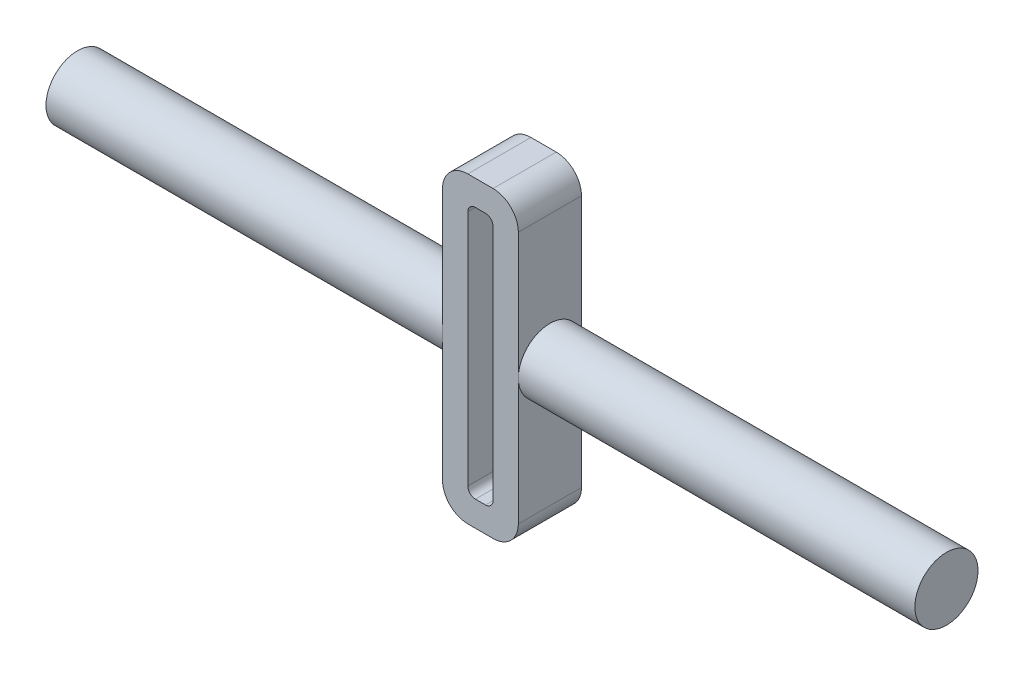
ISO-10303-21;
HEADER;
FILE_DESCRIPTION(('STEP AP214'),'2;1');
FILE_NAME('part.step','',(''),(''),'','','');
FILE_SCHEMA(('AUTOMOTIVE_DESIGN { 1 0 10303 214 1 1 1 1 }'));
ENDSEC;
DATA;
#1=APPLICATION_CONTEXT('core data for automotive mechanical design processes');
#2=APPLICATION_PROTOCOL_DEFINITION('international standard','automotive_design',2000,#1);
#3=PRODUCT_CONTEXT('',#1,'mechanical');
#4=PRODUCT('Part','Part','',(#3));
#5=PRODUCT_RELATED_PRODUCT_CATEGORY('part','',(#4));
#6=PRODUCT_DEFINITION_FORMATION('','',#4);
#7=PRODUCT_DEFINITION_CONTEXT('part definition',#1,'design');
#8=PRODUCT_DEFINITION('design','',#6,#7);
#9=PRODUCT_DEFINITION_SHAPE('','',#8);
#10=(LENGTH_UNIT() NAMED_UNIT(*) SI_UNIT(.MILLI.,.METRE.));
#11=(NAMED_UNIT(*) PLANE_ANGLE_UNIT() SI_UNIT($,.RADIAN.));
#12=(NAMED_UNIT(*) SI_UNIT($,.STERADIAN.) SOLID_ANGLE_UNIT());
#13=UNCERTAINTY_MEASURE_WITH_UNIT(LENGTH_MEASURE(1.E-05),#10,'distance_accuracy_value','');
#14=(GEOMETRIC_REPRESENTATION_CONTEXT(3) GLOBAL_UNCERTAINTY_ASSIGNED_CONTEXT((#13)) GLOBAL_UNIT_ASSIGNED_CONTEXT((#10,
#11,#12)) REPRESENTATION_CONTEXT('',''));
#15=CARTESIAN_POINT('',(0.,0.,0.));
#16=DIRECTION('',(0.,0.,1.));
#17=DIRECTION('',(1.,0.,0.));
#18=AXIS2_PLACEMENT_3D('',#15,#16,#17);
#19=CARTESIAN_POINT('',(-175.,0.,12.5));
#20=DIRECTION('',(1.,0.,0.));
#21=DIRECTION('',(0.,1.,0.));
#22=AXIS2_PLACEMENT_3D('',#19,#20,#21);
#23=CYLINDRICAL_SURFACE('',#22,12.5);
#24=CARTESIAN_POINT('',(-15.,0.,12.5));
#25=DIRECTION('',(1.,0.,0.));
#26=DIRECTION('',(0.,1.,0.));
#27=AXIS2_PLACEMENT_3D('',#24,#25,#26);
#28=CIRCLE('',#27,12.5);
#29=CARTESIAN_POINT('',(-15.,0.,25.));
#30=VERTEX_POINT('',#29);
#31=CARTESIAN_POINT('',(-15.,0.,0.));
#32=VERTEX_POINT('',#31);
#33=EDGE_CURVE('E188',#30,#32,#28,.T.);
#34=ORIENTED_EDGE('',*,*,#33,.F.);
#35=EDGE_CURVE('E180',#32,#30,#28,.T.);
#36=ORIENTED_EDGE('',*,*,#35,.F.);
#37=EDGE_LOOP('',(#34,#36));
#38=FACE_BOUND('',#37,.T.);
#39=CARTESIAN_POINT('',(-172.,0.,12.5));
#40=DIRECTION('',(-1.,0.,0.));
#41=DIRECTION('',(0.,-1.,0.));
#42=AXIS2_PLACEMENT_3D('',#39,#40,#41);
#43=CIRCLE('',#42,12.5);
#44=CARTESIAN_POINT('',(-172.,-12.5,12.5));
#45=VERTEX_POINT('',#44);
#46=EDGE_CURVE('E434',#45,#45,#43,.T.);
#47=ORIENTED_EDGE('',*,*,#46,.F.);
#48=EDGE_LOOP('',(#47));
#49=FACE_BOUND('',#48,.T.);
#50=ADVANCED_FACE('F33',(#38,#49),#23,.T.);
#51=CARTESIAN_POINT('',(175.,0.,12.5));
#52=DIRECTION('',(-1.,0.,0.));
#53=DIRECTION('',(0.,-1.,0.));
#54=AXIS2_PLACEMENT_3D('',#51,#52,#53);
#55=CYLINDRICAL_SURFACE('',#54,12.5);
#56=CARTESIAN_POINT('',(15.,0.,12.5));
#57=DIRECTION('',(-1.,0.,0.));
#58=DIRECTION('',(0.,-1.,0.));
#59=AXIS2_PLACEMENT_3D('',#56,#57,#58);
#60=CIRCLE('',#59,12.5);
#61=CARTESIAN_POINT('',(15.,0.,25.));
#62=VERTEX_POINT('',#61);
#63=CARTESIAN_POINT('',(15.,0.,0.));
#64=VERTEX_POINT('',#63);
#65=EDGE_CURVE('E178',#62,#64,#60,.T.);
#66=ORIENTED_EDGE('',*,*,#65,.F.);
#67=EDGE_CURVE('E165',#64,#62,#60,.T.);
#68=ORIENTED_EDGE('',*,*,#67,.F.);
#69=EDGE_LOOP('',(#66,#68));
#70=FACE_BOUND('',#69,.T.);
#71=CARTESIAN_POINT('',(172.,0.,12.5));
#72=DIRECTION('',(1.,0.,0.));
#73=DIRECTION('',(0.,1.,0.));
#74=AXIS2_PLACEMENT_3D('',#71,#72,#73);
#75=CIRCLE('',#74,12.5);
#76=CARTESIAN_POINT('',(172.,12.5,12.5));
#77=VERTEX_POINT('',#76);
#78=EDGE_CURVE('E189',#77,#77,#75,.T.);
#79=ORIENTED_EDGE('',*,*,#78,.F.);
#80=EDGE_LOOP('',(#79));
#81=FACE_BOUND('',#80,.T.);
#82=ADVANCED_FACE('F176',(#70,#81),#55,.T.);
#83=CARTESIAN_POINT('',(15.,-60.,0.));
#84=DIRECTION('',(1.,0.,0.));
#85=DIRECTION('',(0.,1.,0.));
#86=AXIS2_PLACEMENT_3D('',#83,#84,#85);
#87=PLANE('',#86);
#88=DIRECTION('',(0.,1.,0.));
#89=VECTOR('',#88,1.);
#90=CARTESIAN_POINT('',(15.,-60.,0.));
#91=LINE('',#90,#89);
#92=CARTESIAN_POINT('',(15.,50.,0.));
#93=VERTEX_POINT('',#92);
#94=EDGE_CURVE('E171',#64,#93,#91,.T.);
#95=ORIENTED_EDGE('',*,*,#94,.T.);
#96=DIRECTION('',(0.,0.,1.));
#97=VECTOR('',#96,1.);
#98=CARTESIAN_POINT('',(15.,50.,0.));
#99=LINE('',#98,#97);
#100=CARTESIAN_POINT('',(15.,50.,25.));
#101=VERTEX_POINT('',#100);
#102=EDGE_CURVE('E41',#93,#101,#99,.T.);
#103=ORIENTED_EDGE('',*,*,#102,.T.);
#104=DIRECTION('',(0.,1.,0.));
#105=VECTOR('',#104,1.);
#106=CARTESIAN_POINT('',(15.,-60.,25.));
#107=LINE('',#106,#105);
#108=EDGE_CURVE('E187',#62,#101,#107,.T.);
#109=ORIENTED_EDGE('',*,*,#108,.F.);
#110=ORIENTED_EDGE('',*,*,#65,.T.);
#111=EDGE_LOOP('',(#95,#103,#109,#110));
#112=FACE_BOUND('',#111,.T.);
#113=ADVANCED_FACE('F183',(#112),#87,.T.);
#114=CARTESIAN_POINT('',(-15.,60.,0.));
#115=DIRECTION('',(-1.,0.,0.));
#116=DIRECTION('',(0.,-1.,0.));
#117=AXIS2_PLACEMENT_3D('',#114,#115,#116);
#118=PLANE('',#117);
#119=DIRECTION('',(0.,-1.,0.));
#120=VECTOR('',#119,1.);
#121=CARTESIAN_POINT('',(-15.,60.,0.));
#122=LINE('',#121,#120);
#123=CARTESIAN_POINT('',(-15.,-50.,0.));
#124=VERTEX_POINT('',#123);
#125=EDGE_CURVE('E210',#32,#124,#122,.T.);
#126=ORIENTED_EDGE('',*,*,#125,.T.);
#127=DIRECTION('',(0.,0.,1.));
#128=VECTOR('',#127,1.);
#129=CARTESIAN_POINT('',(-15.,-50.,0.));
#130=LINE('',#129,#128);
#131=CARTESIAN_POINT('',(-15.,-50.,25.));
#132=VERTEX_POINT('',#131);
#133=EDGE_CURVE('E11',#124,#132,#130,.T.);
#134=ORIENTED_EDGE('',*,*,#133,.T.);
#135=DIRECTION('',(0.,-1.,0.));
#136=VECTOR('',#135,1.);
#137=CARTESIAN_POINT('',(-15.,60.,25.));
#138=LINE('',#137,#136);
#139=EDGE_CURVE('E202',#30,#132,#138,.T.);
#140=ORIENTED_EDGE('',*,*,#139,.F.);
#141=ORIENTED_EDGE('',*,*,#33,.T.);
#142=EDGE_LOOP('',(#126,#134,#140,#141));
#143=FACE_BOUND('',#142,.T.);
#144=ADVANCED_FACE('F288',(#143),#118,.T.);
#145=CARTESIAN_POINT('',(-15.,50.,25.));
#146=VERTEX_POINT('',#145);
#147=EDGE_CURVE('E199',#146,#30,#138,.T.);
#148=ORIENTED_EDGE('',*,*,#147,.F.);
#149=DIRECTION('',(0.,0.,1.));
#150=VECTOR('',#149,1.);
#151=CARTESIAN_POINT('',(-15.,50.,0.));
#152=LINE('',#151,#150);
#153=CARTESIAN_POINT('',(-15.,50.,0.));
#154=VERTEX_POINT('',#153);
#155=EDGE_CURVE('E271',#146,#154,#152,.F.);
#156=ORIENTED_EDGE('',*,*,#155,.T.);
#157=EDGE_CURVE('E193',#154,#32,#122,.T.);
#158=ORIENTED_EDGE('',*,*,#157,.T.);
#159=ORIENTED_EDGE('',*,*,#35,.T.);
#160=EDGE_LOOP('',(#148,#156,#158,#159));
#161=FACE_BOUND('',#160,.T.);
#162=ADVANCED_FACE('F320',(#161),#118,.T.);
#163=CARTESIAN_POINT('',(15.,60.,0.));
#164=DIRECTION('',(0.,1.,0.));
#165=DIRECTION('',(0.,0.,1.));
#166=AXIS2_PLACEMENT_3D('',#163,#164,#165);
#167=PLANE('',#166);
#168=DIRECTION('',(-1.,0.,0.));
#169=VECTOR('',#168,1.);
#170=CARTESIAN_POINT('',(15.,60.,0.));
#171=LINE('',#170,#169);
#172=CARTESIAN_POINT('',(5.,60.,0.));
#173=VERTEX_POINT('',#172);
#174=CARTESIAN_POINT('',(-5.,60.,0.));
#175=VERTEX_POINT('',#174);
#176=EDGE_CURVE('E170',#173,#175,#171,.T.);
#177=ORIENTED_EDGE('',*,*,#176,.T.);
#178=DIRECTION('',(0.,0.,1.));
#179=VECTOR('',#178,1.);
#180=CARTESIAN_POINT('',(-5.,60.,0.));
#181=LINE('',#180,#179);
#182=CARTESIAN_POINT('',(-5.,60.,25.));
#183=VERTEX_POINT('',#182);
#184=EDGE_CURVE('E268',#175,#183,#181,.T.);
#185=ORIENTED_EDGE('',*,*,#184,.T.);
#186=DIRECTION('',(-1.,0.,0.));
#187=VECTOR('',#186,1.);
#188=CARTESIAN_POINT('',(15.,60.,25.));
#189=LINE('',#188,#187);
#190=CARTESIAN_POINT('',(5.,60.,25.));
#191=VERTEX_POINT('',#190);
#192=EDGE_CURVE('E207',#191,#183,#189,.T.);
#193=ORIENTED_EDGE('',*,*,#192,.F.);
#194=DIRECTION('',(0.,0.,1.));
#195=VECTOR('',#194,1.);
#196=CARTESIAN_POINT('',(5.,60.,0.));
#197=LINE('',#196,#195);
#198=EDGE_CURVE('E266',#191,#173,#197,.F.);
#199=ORIENTED_EDGE('',*,*,#198,.T.);
#200=EDGE_LOOP('',(#177,#185,#193,#199));
#201=FACE_BOUND('',#200,.T.);
#202=ADVANCED_FACE('F393',(#201),#167,.T.);
#203=CARTESIAN_POINT('',(15.,-50.,25.));
#204=VERTEX_POINT('',#203);
#205=EDGE_CURVE('E205',#204,#62,#107,.T.);
#206=ORIENTED_EDGE('',*,*,#205,.F.);
#207=DIRECTION('',(0.,0.,1.));
#208=VECTOR('',#207,1.);
#209=CARTESIAN_POINT('',(15.,-50.,0.));
#210=LINE('',#209,#208);
#211=CARTESIAN_POINT('',(15.,-50.,0.));
#212=VERTEX_POINT('',#211);
#213=EDGE_CURVE('E168',#204,#212,#210,.F.);
#214=ORIENTED_EDGE('',*,*,#213,.T.);
#215=EDGE_CURVE('E161',#212,#64,#91,.T.);
#216=ORIENTED_EDGE('',*,*,#215,.T.);
#217=ORIENTED_EDGE('',*,*,#67,.T.);
#218=EDGE_LOOP('',(#206,#214,#216,#217));
#219=FACE_BOUND('',#218,.T.);
#220=ADVANCED_FACE('F164',(#219),#87,.T.);
#221=CARTESIAN_POINT('',(-15.,-60.,0.));
#222=DIRECTION('',(0.,-1.,0.));
#223=DIRECTION('',(0.,0.,-1.));
#224=AXIS2_PLACEMENT_3D('',#221,#222,#223);
#225=PLANE('',#224);
#226=DIRECTION('',(1.,0.,0.));
#227=VECTOR('',#226,1.);
#228=CARTESIAN_POINT('',(-15.,-60.,0.));
#229=LINE('',#228,#227);
#230=CARTESIAN_POINT('',(-4.99999999999999,-60.,0.));
#231=VERTEX_POINT('',#230);
#232=CARTESIAN_POINT('',(5.00000000000001,-60.,0.));
#233=VERTEX_POINT('',#232);
#234=EDGE_CURVE('E191',#231,#233,#229,.T.);
#235=ORIENTED_EDGE('',*,*,#234,.T.);
#236=DIRECTION('',(0.,0.,1.));
#237=VECTOR('',#236,1.);
#238=CARTESIAN_POINT('',(5.00000000000001,-60.,0.));
#239=LINE('',#238,#237);
#240=CARTESIAN_POINT('',(5.00000000000001,-60.,25.));
#241=VERTEX_POINT('',#240);
#242=EDGE_CURVE('E248',#233,#241,#239,.T.);
#243=ORIENTED_EDGE('',*,*,#242,.T.);
#244=DIRECTION('',(1.,0.,0.));
#245=VECTOR('',#244,1.);
#246=CARTESIAN_POINT('',(-15.,-60.,25.));
#247=LINE('',#246,#245);
#248=CARTESIAN_POINT('',(-4.99999999999999,-60.,25.));
#249=VERTEX_POINT('',#248);
#250=EDGE_CURVE('E201',#249,#241,#247,.T.);
#251=ORIENTED_EDGE('',*,*,#250,.F.);
#252=DIRECTION('',(0.,0.,1.));
#253=VECTOR('',#252,1.);
#254=CARTESIAN_POINT('',(-4.99999999999999,-60.,0.));
#255=LINE('',#254,#253);
#256=EDGE_CURVE('E246',#249,#231,#255,.F.);
#257=ORIENTED_EDGE('',*,*,#256,.T.);
#258=EDGE_LOOP('',(#235,#243,#251,#257));
#259=FACE_BOUND('',#258,.T.);
#260=ADVANCED_FACE('F280',(#259),#225,.T.);
#261=CARTESIAN_POINT('',(0.,0.,0.));
#262=DIRECTION('',(0.,0.,1.));
#263=DIRECTION('',(1.,0.,0.));
#264=AXIS2_PLACEMENT_3D('',#261,#262,#263);
#265=PLANE('',#264);
#266=DIRECTION('',(0.,1.,0.));
#267=VECTOR('',#266,1.);
#268=CARTESIAN_POINT('',(-4.99999999999999,-50.,0.));
#269=LINE('',#268,#267);
#270=CARTESIAN_POINT('',(-4.99999999999999,-47.,0.));
#271=VERTEX_POINT('',#270);
#272=CARTESIAN_POINT('',(-5.,47.,0.));
#273=VERTEX_POINT('',#272);
#274=EDGE_CURVE('E307',#271,#273,#269,.T.);
#275=ORIENTED_EDGE('',*,*,#274,.F.);
#276=CARTESIAN_POINT('',(-1.99999999999999,-47.,0.));
#277=DIRECTION('',(0.,0.,1.));
#278=DIRECTION('',(1.,0.,0.));
#279=AXIS2_PLACEMENT_3D('',#276,#277,#278);
#280=CIRCLE('',#279,3.);
#281=CARTESIAN_POINT('',(-1.99999999999999,-50.,0.));
#282=VERTEX_POINT('',#281);
#283=EDGE_CURVE('E230',#271,#282,#280,.T.);
#284=ORIENTED_EDGE('',*,*,#283,.T.);
#285=DIRECTION('',(-1.,0.,0.));
#286=VECTOR('',#285,1.);
#287=CARTESIAN_POINT('',(5.00000000000001,-50.,0.));
#288=LINE('',#287,#286);
#289=CARTESIAN_POINT('',(2.00000000000001,-50.,0.));
#290=VERTEX_POINT('',#289);
#291=EDGE_CURVE('E304',#290,#282,#288,.T.);
#292=ORIENTED_EDGE('',*,*,#291,.F.);
#293=CARTESIAN_POINT('',(2.00000000000001,-47.,0.));
#294=DIRECTION('',(0.,0.,1.));
#295=DIRECTION('',(1.,0.,0.));
#296=AXIS2_PLACEMENT_3D('',#293,#294,#295);
#297=CIRCLE('',#296,3.);
#298=CARTESIAN_POINT('',(5.00000000000001,-47.,0.));
#299=VERTEX_POINT('',#298);
#300=EDGE_CURVE('E238',#290,#299,#297,.T.);
#301=ORIENTED_EDGE('',*,*,#300,.T.);
#302=DIRECTION('',(0.,-1.,0.));
#303=VECTOR('',#302,1.);
#304=CARTESIAN_POINT('',(5.,50.,0.));
#305=LINE('',#304,#303);
#306=CARTESIAN_POINT('',(5.,47.,0.));
#307=VERTEX_POINT('',#306);
#308=EDGE_CURVE('E313',#307,#299,#305,.T.);
#309=ORIENTED_EDGE('',*,*,#308,.F.);
#310=CARTESIAN_POINT('',(2.,47.,0.));
#311=DIRECTION('',(0.,0.,1.));
#312=DIRECTION('',(1.,0.,0.));
#313=AXIS2_PLACEMENT_3D('',#310,#311,#312);
#314=CIRCLE('',#313,3.);
#315=CARTESIAN_POINT('',(2.,50.,0.));
#316=VERTEX_POINT('',#315);
#317=EDGE_CURVE('E242',#307,#316,#314,.T.);
#318=ORIENTED_EDGE('',*,*,#317,.T.);
#319=DIRECTION('',(1.,0.,0.));
#320=VECTOR('',#319,1.);
#321=CARTESIAN_POINT('',(-5.,50.,0.));
#322=LINE('',#321,#320);
#323=CARTESIAN_POINT('',(-2.,50.,0.));
#324=VERTEX_POINT('',#323);
#325=EDGE_CURVE('E310',#324,#316,#322,.T.);
#326=ORIENTED_EDGE('',*,*,#325,.F.);
#327=CARTESIAN_POINT('',(-2.,47.,0.));
#328=DIRECTION('',(0.,0.,1.));
#329=DIRECTION('',(1.,0.,0.));
#330=AXIS2_PLACEMENT_3D('',#327,#328,#329);
#331=CIRCLE('',#330,3.);
#332=EDGE_CURVE('E234',#324,#273,#331,.T.);
#333=ORIENTED_EDGE('',*,*,#332,.T.);
#334=EDGE_LOOP('',(#275,#284,#292,#301,#309,#318,#326,#333));
#335=FACE_BOUND('',#334,.T.);
#336=ORIENTED_EDGE('',*,*,#215,.F.);
#337=CARTESIAN_POINT('',(5.00000000000001,-50.,0.));
#338=DIRECTION('',(0.,0.,1.));
#339=DIRECTION('',(1.,0.,0.));
#340=AXIS2_PLACEMENT_3D('',#337,#338,#339);
#341=CIRCLE('',#340,10.);
#342=EDGE_CURVE('E264',#212,#233,#341,.F.);
#343=ORIENTED_EDGE('',*,*,#342,.T.);
#344=ORIENTED_EDGE('',*,*,#234,.F.);
#345=CARTESIAN_POINT('',(-4.99999999999999,-50.,0.));
#346=DIRECTION('',(0.,0.,1.));
#347=DIRECTION('',(1.,0.,0.));
#348=AXIS2_PLACEMENT_3D('',#345,#346,#347);
#349=CIRCLE('',#348,10.);
#350=EDGE_CURVE('E48',#231,#124,#349,.F.);
#351=ORIENTED_EDGE('',*,*,#350,.T.);
#352=ORIENTED_EDGE('',*,*,#125,.F.);
#353=ORIENTED_EDGE('',*,*,#157,.F.);
#354=CARTESIAN_POINT('',(-5.,50.,0.));
#355=DIRECTION('',(0.,0.,1.));
#356=DIRECTION('',(1.,0.,0.));
#357=AXIS2_PLACEMENT_3D('',#354,#355,#356);
#358=CIRCLE('',#357,10.);
#359=EDGE_CURVE('E262',#154,#175,#358,.F.);
#360=ORIENTED_EDGE('',*,*,#359,.T.);
#361=ORIENTED_EDGE('',*,*,#176,.F.);
#362=CARTESIAN_POINT('',(5.,50.,0.));
#363=DIRECTION('',(0.,0.,1.));
#364=DIRECTION('',(1.,0.,0.));
#365=AXIS2_PLACEMENT_3D('',#362,#363,#364);
#366=CIRCLE('',#365,10.);
#367=EDGE_CURVE('E55',#173,#93,#366,.F.);
#368=ORIENTED_EDGE('',*,*,#367,.T.);
#369=ORIENTED_EDGE('',*,*,#94,.F.);
#370=EDGE_LOOP('',(#336,#343,#344,#351,#352,#353,#360,#361,#368,#369));
#371=FACE_BOUND('',#370,.T.);
#372=ADVANCED_FACE('F190',(#335,#371),#265,.F.);
#373=CARTESIAN_POINT('',(0.,0.,25.));
#374=DIRECTION('',(0.,0.,1.));
#375=DIRECTION('',(1.,0.,0.));
#376=AXIS2_PLACEMENT_3D('',#373,#374,#375);
#377=PLANE('',#376);
#378=DIRECTION('',(0.,-1.,0.));
#379=VECTOR('',#378,1.);
#380=CARTESIAN_POINT('',(5.,50.,25.));
#381=LINE('',#380,#379);
#382=CARTESIAN_POINT('',(5.,47.,25.));
#383=VERTEX_POINT('',#382);
#384=CARTESIAN_POINT('',(5.00000000000001,-47.,25.));
#385=VERTEX_POINT('',#384);
#386=EDGE_CURVE('E292',#383,#385,#381,.T.);
#387=ORIENTED_EDGE('',*,*,#386,.T.);
#388=CARTESIAN_POINT('',(2.00000000000001,-47.,25.));
#389=DIRECTION('',(0.,0.,1.));
#390=DIRECTION('',(1.,0.,0.));
#391=AXIS2_PLACEMENT_3D('',#388,#389,#390);
#392=CIRCLE('',#391,3.);
#393=CARTESIAN_POINT('',(2.00000000000001,-50.,25.));
#394=VERTEX_POINT('',#393);
#395=EDGE_CURVE('E240',#385,#394,#392,.F.);
#396=ORIENTED_EDGE('',*,*,#395,.T.);
#397=DIRECTION('',(-1.,0.,0.));
#398=VECTOR('',#397,1.);
#399=CARTESIAN_POINT('',(5.00000000000001,-50.,25.));
#400=LINE('',#399,#398);
#401=CARTESIAN_POINT('',(-1.99999999999999,-50.,25.));
#402=VERTEX_POINT('',#401);
#403=EDGE_CURVE('E315',#394,#402,#400,.T.);
#404=ORIENTED_EDGE('',*,*,#403,.T.);
#405=CARTESIAN_POINT('',(-1.99999999999999,-47.,25.));
#406=DIRECTION('',(0.,0.,1.));
#407=DIRECTION('',(1.,0.,0.));
#408=AXIS2_PLACEMENT_3D('',#405,#406,#407);
#409=CIRCLE('',#408,3.);
#410=CARTESIAN_POINT('',(-4.99999999999999,-47.,25.));
#411=VERTEX_POINT('',#410);
#412=EDGE_CURVE('E232',#402,#411,#409,.F.);
#413=ORIENTED_EDGE('',*,*,#412,.T.);
#414=DIRECTION('',(0.,1.,0.));
#415=VECTOR('',#414,1.);
#416=CARTESIAN_POINT('',(-4.99999999999999,-50.,25.));
#417=LINE('',#416,#415);
#418=CARTESIAN_POINT('',(-5.,47.,25.));
#419=VERTEX_POINT('',#418);
#420=EDGE_CURVE('E300',#411,#419,#417,.T.);
#421=ORIENTED_EDGE('',*,*,#420,.T.);
#422=CARTESIAN_POINT('',(-2.,47.,25.));
#423=DIRECTION('',(0.,0.,1.));
#424=DIRECTION('',(1.,0.,0.));
#425=AXIS2_PLACEMENT_3D('',#422,#423,#424);
#426=CIRCLE('',#425,3.);
#427=CARTESIAN_POINT('',(-2.,50.,25.));
#428=VERTEX_POINT('',#427);
#429=EDGE_CURVE('E236',#419,#428,#426,.F.);
#430=ORIENTED_EDGE('',*,*,#429,.T.);
#431=DIRECTION('',(1.,0.,0.));
#432=VECTOR('',#431,1.);
#433=CARTESIAN_POINT('',(-5.,50.,25.));
#434=LINE('',#433,#432);
#435=CARTESIAN_POINT('',(2.,50.,25.));
#436=VERTEX_POINT('',#435);
#437=EDGE_CURVE('E294',#428,#436,#434,.T.);
#438=ORIENTED_EDGE('',*,*,#437,.T.);
#439=CARTESIAN_POINT('',(2.,47.,25.));
#440=DIRECTION('',(0.,0.,1.));
#441=DIRECTION('',(1.,0.,0.));
#442=AXIS2_PLACEMENT_3D('',#439,#440,#441);
#443=CIRCLE('',#442,3.);
#444=EDGE_CURVE('E244',#436,#383,#443,.F.);
#445=ORIENTED_EDGE('',*,*,#444,.T.);
#446=EDGE_LOOP('',(#387,#396,#404,#413,#421,#430,#438,#445));
#447=FACE_BOUND('',#446,.T.);
#448=ORIENTED_EDGE('',*,*,#250,.T.);
#449=CARTESIAN_POINT('',(5.00000000000001,-50.,25.));
#450=DIRECTION('',(0.,0.,1.));
#451=DIRECTION('',(1.,0.,0.));
#452=AXIS2_PLACEMENT_3D('',#449,#450,#451);
#453=CIRCLE('',#452,10.);
#454=EDGE_CURVE('E257',#241,#204,#453,.T.);
#455=ORIENTED_EDGE('',*,*,#454,.T.);
#456=ORIENTED_EDGE('',*,*,#205,.T.);
#457=ORIENTED_EDGE('',*,*,#108,.T.);
#458=CARTESIAN_POINT('',(5.,50.,25.));
#459=DIRECTION('',(0.,0.,1.));
#460=DIRECTION('',(1.,0.,0.));
#461=AXIS2_PLACEMENT_3D('',#458,#459,#460);
#462=CIRCLE('',#461,10.);
#463=EDGE_CURVE('E253',#101,#191,#462,.T.);
#464=ORIENTED_EDGE('',*,*,#463,.T.);
#465=ORIENTED_EDGE('',*,*,#192,.T.);
#466=CARTESIAN_POINT('',(-5.,50.,25.));
#467=DIRECTION('',(0.,0.,1.));
#468=DIRECTION('',(1.,0.,0.));
#469=AXIS2_PLACEMENT_3D('',#466,#467,#468);
#470=CIRCLE('',#469,10.);
#471=EDGE_CURVE('E255',#183,#146,#470,.T.);
#472=ORIENTED_EDGE('',*,*,#471,.T.);
#473=ORIENTED_EDGE('',*,*,#147,.T.);
#474=ORIENTED_EDGE('',*,*,#139,.T.);
#475=CARTESIAN_POINT('',(-4.99999999999999,-50.,25.));
#476=DIRECTION('',(0.,0.,1.));
#477=DIRECTION('',(1.,0.,0.));
#478=AXIS2_PLACEMENT_3D('',#475,#476,#477);
#479=CIRCLE('',#478,10.);
#480=EDGE_CURVE('E251',#132,#249,#479,.T.);
#481=ORIENTED_EDGE('',*,*,#480,.T.);
#482=EDGE_LOOP('',(#448,#455,#456,#457,#464,#465,#472,#473,#474,#481));
#483=FACE_BOUND('',#482,.T.);
#484=ADVANCED_FACE('F274',(#447,#483),#377,.T.);
#485=CARTESIAN_POINT('',(5.00000000000001,-50.,25.));
#486=DIRECTION('',(0.,-1.,0.));
#487=DIRECTION('',(0.,0.,-1.));
#488=AXIS2_PLACEMENT_3D('',#485,#486,#487);
#489=PLANE('',#488);
#490=ORIENTED_EDGE('',*,*,#291,.T.);
#491=DIRECTION('',(0.,0.,-1.));
#492=VECTOR('',#491,1.);
#493=CARTESIAN_POINT('',(-1.99999999999999,-50.,25.));
#494=LINE('',#493,#492);
#495=EDGE_CURVE('E218',#282,#402,#494,.F.);
#496=ORIENTED_EDGE('',*,*,#495,.T.);
#497=ORIENTED_EDGE('',*,*,#403,.F.);
#498=DIRECTION('',(0.,0.,-1.));
#499=VECTOR('',#498,1.);
#500=CARTESIAN_POINT('',(2.00000000000001,-50.,0.));
#501=LINE('',#500,#499);
#502=EDGE_CURVE('E215',#394,#290,#501,.T.);
#503=ORIENTED_EDGE('',*,*,#502,.T.);
#504=EDGE_LOOP('',(#490,#496,#497,#503));
#505=FACE_BOUND('',#504,.T.);
#506=ADVANCED_FACE('F359',(#505),#489,.F.);
#507=CARTESIAN_POINT('',(5.,50.,25.));
#508=DIRECTION('',(1.,0.,0.));
#509=DIRECTION('',(0.,1.,0.));
#510=AXIS2_PLACEMENT_3D('',#507,#508,#509);
#511=PLANE('',#510);
#512=ORIENTED_EDGE('',*,*,#308,.T.);
#513=DIRECTION('',(0.,0.,-1.));
#514=VECTOR('',#513,1.);
#515=CARTESIAN_POINT('',(5.00000000000001,-47.,25.));
#516=LINE('',#515,#514);
#517=EDGE_CURVE('E228',#299,#385,#516,.F.);
#518=ORIENTED_EDGE('',*,*,#517,.T.);
#519=ORIENTED_EDGE('',*,*,#386,.F.);
#520=DIRECTION('',(0.,0.,-1.));
#521=VECTOR('',#520,1.);
#522=CARTESIAN_POINT('',(5.,47.,0.));
#523=LINE('',#522,#521);
#524=EDGE_CURVE('E225',#383,#307,#523,.T.);
#525=ORIENTED_EDGE('',*,*,#524,.T.);
#526=EDGE_LOOP('',(#512,#518,#519,#525));
#527=FACE_BOUND('',#526,.T.);
#528=ADVANCED_FACE('F352',(#527),#511,.F.);
#529=CARTESIAN_POINT('',(-5.,50.,25.));
#530=DIRECTION('',(0.,1.,0.));
#531=DIRECTION('',(0.,0.,1.));
#532=AXIS2_PLACEMENT_3D('',#529,#530,#531);
#533=PLANE('',#532);
#534=ORIENTED_EDGE('',*,*,#437,.F.);
#535=DIRECTION('',(0.,0.,-1.));
#536=VECTOR('',#535,1.);
#537=CARTESIAN_POINT('',(-2.,50.,0.));
#538=LINE('',#537,#536);
#539=EDGE_CURVE('E222',#428,#324,#538,.T.);
#540=ORIENTED_EDGE('',*,*,#539,.T.);
#541=ORIENTED_EDGE('',*,*,#325,.T.);
#542=DIRECTION('',(0.,0.,-1.));
#543=VECTOR('',#542,1.);
#544=CARTESIAN_POINT('',(2.,50.,25.));
#545=LINE('',#544,#543);
#546=EDGE_CURVE('E220',#316,#436,#545,.F.);
#547=ORIENTED_EDGE('',*,*,#546,.T.);
#548=EDGE_LOOP('',(#534,#540,#541,#547));
#549=FACE_BOUND('',#548,.T.);
#550=ADVANCED_FACE('F342',(#549),#533,.F.);
#551=CARTESIAN_POINT('',(-4.99999999999999,-50.,25.));
#552=DIRECTION('',(-1.,0.,0.));
#553=DIRECTION('',(0.,-1.,0.));
#554=AXIS2_PLACEMENT_3D('',#551,#552,#553);
#555=PLANE('',#554);
#556=ORIENTED_EDGE('',*,*,#420,.F.);
#557=DIRECTION('',(0.,0.,-1.));
#558=VECTOR('',#557,1.);
#559=CARTESIAN_POINT('',(-4.99999999999999,-47.,0.));
#560=LINE('',#559,#558);
#561=EDGE_CURVE('E212',#411,#271,#560,.T.);
#562=ORIENTED_EDGE('',*,*,#561,.T.);
#563=ORIENTED_EDGE('',*,*,#274,.T.);
#564=DIRECTION('',(0.,0.,-1.));
#565=VECTOR('',#564,1.);
#566=CARTESIAN_POINT('',(-5.,47.,25.));
#567=LINE('',#566,#565);
#568=EDGE_CURVE('E179',#273,#419,#567,.F.);
#569=ORIENTED_EDGE('',*,*,#568,.T.);
#570=EDGE_LOOP('',(#556,#562,#563,#569));
#571=FACE_BOUND('',#570,.T.);
#572=ADVANCED_FACE('F364',(#571),#555,.F.);
#573=CARTESIAN_POINT('',(-1.99999999999999,-47.,25.));
#574=DIRECTION('',(0.,0.,1.));
#575=DIRECTION('',(1.,0.,0.));
#576=AXIS2_PLACEMENT_3D('',#573,#574,#575);
#577=CYLINDRICAL_SURFACE('',#576,3.);
#578=ORIENTED_EDGE('',*,*,#412,.F.);
#579=ORIENTED_EDGE('',*,*,#495,.F.);
#580=ORIENTED_EDGE('',*,*,#283,.F.);
#581=ORIENTED_EDGE('',*,*,#561,.F.);
#582=EDGE_LOOP('',(#578,#579,#580,#581));
#583=FACE_BOUND('',#582,.T.);
#584=ADVANCED_FACE('F363',(#583),#577,.F.);
#585=CARTESIAN_POINT('',(-2.,47.,25.));
#586=DIRECTION('',(0.,0.,1.));
#587=DIRECTION('',(1.,0.,0.));
#588=AXIS2_PLACEMENT_3D('',#585,#586,#587);
#589=CYLINDRICAL_SURFACE('',#588,3.);
#590=ORIENTED_EDGE('',*,*,#429,.F.);
#591=ORIENTED_EDGE('',*,*,#568,.F.);
#592=ORIENTED_EDGE('',*,*,#332,.F.);
#593=ORIENTED_EDGE('',*,*,#539,.F.);
#594=EDGE_LOOP('',(#590,#591,#592,#593));
#595=FACE_BOUND('',#594,.T.);
#596=ADVANCED_FACE('F339',(#595),#589,.F.);
#597=CARTESIAN_POINT('',(2.00000000000001,-47.,25.));
#598=DIRECTION('',(0.,0.,1.));
#599=DIRECTION('',(1.,0.,0.));
#600=AXIS2_PLACEMENT_3D('',#597,#598,#599);
#601=CYLINDRICAL_SURFACE('',#600,3.);
#602=ORIENTED_EDGE('',*,*,#395,.F.);
#603=ORIENTED_EDGE('',*,*,#517,.F.);
#604=ORIENTED_EDGE('',*,*,#300,.F.);
#605=ORIENTED_EDGE('',*,*,#502,.F.);
#606=EDGE_LOOP('',(#602,#603,#604,#605));
#607=FACE_BOUND('',#606,.T.);
#608=ADVANCED_FACE('F355',(#607),#601,.F.);
#609=CARTESIAN_POINT('',(2.,47.,25.));
#610=DIRECTION('',(0.,0.,1.));
#611=DIRECTION('',(1.,0.,0.));
#612=AXIS2_PLACEMENT_3D('',#609,#610,#611);
#613=CYLINDRICAL_SURFACE('',#612,3.);
#614=ORIENTED_EDGE('',*,*,#444,.F.);
#615=ORIENTED_EDGE('',*,*,#546,.F.);
#616=ORIENTED_EDGE('',*,*,#317,.F.);
#617=ORIENTED_EDGE('',*,*,#524,.F.);
#618=EDGE_LOOP('',(#614,#615,#616,#617));
#619=FACE_BOUND('',#618,.T.);
#620=ADVANCED_FACE('F350',(#619),#613,.F.);
#621=CARTESIAN_POINT('',(5.00000000000001,-50.,0.));
#622=DIRECTION('',(0.,0.,1.));
#623=DIRECTION('',(1.,0.,0.));
#624=AXIS2_PLACEMENT_3D('',#621,#622,#623);
#625=CYLINDRICAL_SURFACE('',#624,10.);
#626=ORIENTED_EDGE('',*,*,#342,.F.);
#627=ORIENTED_EDGE('',*,*,#213,.F.);
#628=ORIENTED_EDGE('',*,*,#454,.F.);
#629=ORIENTED_EDGE('',*,*,#242,.F.);
#630=EDGE_LOOP('',(#626,#627,#628,#629));
#631=FACE_BOUND('',#630,.T.);
#632=ADVANCED_FACE('F277',(#631),#625,.T.);
#633=CARTESIAN_POINT('',(-5.,50.,0.));
#634=DIRECTION('',(0.,0.,1.));
#635=DIRECTION('',(1.,0.,0.));
#636=AXIS2_PLACEMENT_3D('',#633,#634,#635);
#637=CYLINDRICAL_SURFACE('',#636,10.);
#638=ORIENTED_EDGE('',*,*,#359,.F.);
#639=ORIENTED_EDGE('',*,*,#155,.F.);
#640=ORIENTED_EDGE('',*,*,#471,.F.);
#641=ORIENTED_EDGE('',*,*,#184,.F.);
#642=EDGE_LOOP('',(#638,#639,#640,#641));
#643=FACE_BOUND('',#642,.T.);
#644=ADVANCED_FACE('F411',(#643),#637,.T.);
#645=CARTESIAN_POINT('',(5.,50.,0.));
#646=DIRECTION('',(0.,0.,1.));
#647=DIRECTION('',(1.,0.,0.));
#648=AXIS2_PLACEMENT_3D('',#645,#646,#647);
#649=CYLINDRICAL_SURFACE('',#648,10.);
#650=ORIENTED_EDGE('',*,*,#367,.F.);
#651=ORIENTED_EDGE('',*,*,#198,.F.);
#652=ORIENTED_EDGE('',*,*,#463,.F.);
#653=ORIENTED_EDGE('',*,*,#102,.F.);
#654=EDGE_LOOP('',(#650,#651,#652,#653));
#655=FACE_BOUND('',#654,.T.);
#656=ADVANCED_FACE('F413',(#655),#649,.T.);
#657=CARTESIAN_POINT('',(-4.99999999999999,-50.,0.));
#658=DIRECTION('',(0.,0.,1.));
#659=DIRECTION('',(1.,0.,0.));
#660=AXIS2_PLACEMENT_3D('',#657,#658,#659);
#661=CYLINDRICAL_SURFACE('',#660,10.);
#662=ORIENTED_EDGE('',*,*,#350,.F.);
#663=ORIENTED_EDGE('',*,*,#256,.F.);
#664=ORIENTED_EDGE('',*,*,#480,.F.);
#665=ORIENTED_EDGE('',*,*,#133,.F.);
#666=EDGE_LOOP('',(#662,#663,#664,#665));
#667=FACE_BOUND('',#666,.T.);
#668=ADVANCED_FACE('F35',(#667),#661,.T.);
#669=CARTESIAN_POINT('',(172.,0.,12.5));
#670=DIRECTION('',(1.,0.,0.));
#671=DIRECTION('',(0.,1.,0.));
#672=AXIS2_PLACEMENT_3D('',#669,#670,#671);
#673=PLANE('',#672);
#674=ORIENTED_EDGE('',*,*,#78,.T.);
#675=EDGE_LOOP('',(#674));
#676=FACE_BOUND('',#675,.T.);
#677=ADVANCED_FACE('F419',(#676),#673,.T.);
#678=CARTESIAN_POINT('',(-172.,0.,12.5));
#679=DIRECTION('',(-1.,0.,0.));
#680=DIRECTION('',(0.,-1.,0.));
#681=AXIS2_PLACEMENT_3D('',#678,#679,#680);
#682=PLANE('',#681);
#683=ORIENTED_EDGE('',*,*,#46,.T.);
#684=EDGE_LOOP('',(#683));
#685=FACE_BOUND('',#684,.T.);
#686=ADVANCED_FACE('F425',(#685),#682,.T.);
#687=CLOSED_SHELL('',(#50,#82,#113,#144,#162,#202,#220,#260,#372,#484,#506,#528,#550,#572,#584,
#596,#608,#620,#632,#644,#656,#668,#677,#686));
#688=MANIFOLD_SOLID_BREP('B2',#687);
#689=ADVANCED_BREP_SHAPE_REPRESENTATION('',(#18,#688),#14);
#690=SHAPE_DEFINITION_REPRESENTATION(#9,#689);
ENDSEC;
END-ISO-10303-21;
